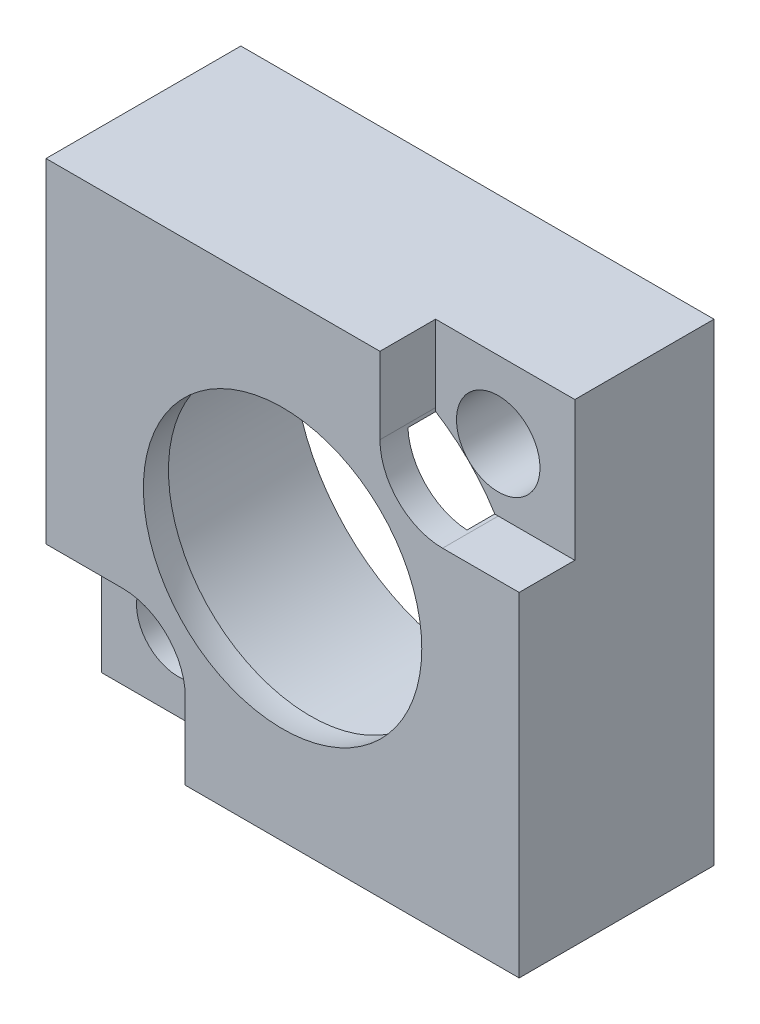
ISO-10303-21;
HEADER;
FILE_DESCRIPTION(('STEP AP214'),'2;1');
FILE_NAME('part.step','',(''),(''),'','','');
FILE_SCHEMA(('AUTOMOTIVE_DESIGN { 1 0 10303 214 1 1 1 1 }'));
ENDSEC;
DATA;
#1=APPLICATION_CONTEXT('core data for automotive mechanical design processes');
#2=APPLICATION_PROTOCOL_DEFINITION('international standard','automotive_design',2000,#1);
#3=PRODUCT_CONTEXT('',#1,'mechanical');
#4=PRODUCT('Part','Part','',(#3));
#5=PRODUCT_RELATED_PRODUCT_CATEGORY('part','',(#4));
#6=PRODUCT_DEFINITION_FORMATION('','',#4);
#7=PRODUCT_DEFINITION_CONTEXT('part definition',#1,'design');
#8=PRODUCT_DEFINITION('design','',#6,#7);
#9=PRODUCT_DEFINITION_SHAPE('','',#8);
#10=(LENGTH_UNIT() NAMED_UNIT(*) SI_UNIT(.MILLI.,.METRE.));
#11=(NAMED_UNIT(*) PLANE_ANGLE_UNIT() SI_UNIT($,.RADIAN.));
#12=(NAMED_UNIT(*) SI_UNIT($,.STERADIAN.) SOLID_ANGLE_UNIT());
#13=UNCERTAINTY_MEASURE_WITH_UNIT(LENGTH_MEASURE(1.E-05),#10,'distance_accuracy_value','');
#14=(GEOMETRIC_REPRESENTATION_CONTEXT(3) GLOBAL_UNCERTAINTY_ASSIGNED_CONTEXT((#13)) GLOBAL_UNIT_ASSIGNED_CONTEXT((#10,
#11,#12)) REPRESENTATION_CONTEXT('',''));
#15=CARTESIAN_POINT('',(0.,0.,0.));
#16=DIRECTION('',(0.,0.,1.));
#17=DIRECTION('',(1.,0.,0.));
#18=AXIS2_PLACEMENT_3D('',#15,#16,#17);
#19=CARTESIAN_POINT('',(0.,0.,6.));
#20=DIRECTION('',(0.,0.,1.));
#21=DIRECTION('',(1.,0.,0.));
#22=AXIS2_PLACEMENT_3D('',#19,#20,#21);
#23=PLANE('',#22);
#24=CARTESIAN_POINT('',(0.,0.,6.));
#25=DIRECTION('',(0.,0.,1.));
#26=DIRECTION('',(1.,0.,0.));
#27=AXIS2_PLACEMENT_3D('',#24,#25,#26);
#28=CIRCLE('',#27,5.00099990001999);
#29=CARTESIAN_POINT('',(5.00099990001999,0.,6.));
#30=VERTEX_POINT('',#29);
#31=EDGE_CURVE('E167',#30,#30,#28,.T.);
#32=ORIENTED_EDGE('',*,*,#31,.F.);
#33=EDGE_LOOP('',(#32));
#34=FACE_BOUND('',#33,.T.);
#35=DIRECTION('',(-1.,0.,0.));
#36=VECTOR('',#35,1.);
#37=CARTESIAN_POINT('',(0.,-3.49771727612784,6.00000000000003));
#38=LINE('',#37,#36);
#39=CARTESIAN_POINT('',(-5.74771727612784,-3.49771727612784,6.00000000000008));
#40=VERTEX_POINT('',#39);
#41=CARTESIAN_POINT('',(-8.49999999999995,-3.49771727612784,6.00000000000011));
#42=VERTEX_POINT('',#41);
#43=EDGE_CURVE('E196',#40,#42,#38,.T.);
#44=ORIENTED_EDGE('',*,*,#43,.F.);
#45=CARTESIAN_POINT('',(-5.74771727612784,-5.74771727612784,6.0000000000001));
#46=DIRECTION('',(0.,0.,-1.));
#47=DIRECTION('',(0.,-1.,0.));
#48=AXIS2_PLACEMENT_3D('',#45,#46,#47);
#49=CIRCLE('',#48,2.25);
#50=CARTESIAN_POINT('',(-3.49771727612784,-5.74771727612784,6.00000000000008));
#51=VERTEX_POINT('',#50);
#52=EDGE_CURVE('E199',#40,#51,#49,.T.);
#53=ORIENTED_EDGE('',*,*,#52,.T.);
#54=DIRECTION('',(0.,1.,0.));
#55=VECTOR('',#54,1.);
#56=CARTESIAN_POINT('',(-3.49771727612784,0.,6.00000000000003));
#57=LINE('',#56,#55);
#58=CARTESIAN_POINT('',(-3.49771727612784,-8.49999999999993,6.00000000000011));
#59=VERTEX_POINT('',#58);
#60=EDGE_CURVE('E212',#59,#51,#57,.T.);
#61=ORIENTED_EDGE('',*,*,#60,.F.);
#62=DIRECTION('',(1.,0.,0.));
#63=VECTOR('',#62,1.);
#64=CARTESIAN_POINT('',(0.,-8.5,6.));
#65=LINE('',#64,#63);
#66=CARTESIAN_POINT('',(8.50000000000003,-8.49999999999997,6.));
#67=VERTEX_POINT('',#66);
#68=EDGE_CURVE('E269',#59,#67,#65,.T.);
#69=ORIENTED_EDGE('',*,*,#68,.T.);
#70=DIRECTION('',(0.,1.,0.));
#71=VECTOR('',#70,1.);
#72=CARTESIAN_POINT('',(8.5,0.,6.));
#73=LINE('',#72,#71);
#74=CARTESIAN_POINT('',(8.49999999999999,3.49771727612789,6.));
#75=VERTEX_POINT('',#74);
#76=EDGE_CURVE('E266',#67,#75,#73,.T.);
#77=ORIENTED_EDGE('',*,*,#76,.T.);
#78=DIRECTION('',(-1.,0.,0.));
#79=VECTOR('',#78,1.);
#80=CARTESIAN_POINT('',(0.,3.49771727612789,6.));
#81=LINE('',#80,#79);
#82=CARTESIAN_POINT('',(5.74771727612789,3.49771727612789,6.));
#83=VERTEX_POINT('',#82);
#84=EDGE_CURVE('E236',#75,#83,#81,.T.);
#85=ORIENTED_EDGE('',*,*,#84,.T.);
#86=CARTESIAN_POINT('',(5.74771727612789,5.74771727612789,6.));
#87=DIRECTION('',(0.,0.,1.));
#88=DIRECTION('',(1.,0.,0.));
#89=AXIS2_PLACEMENT_3D('',#86,#87,#88);
#90=CIRCLE('',#89,2.25);
#91=CARTESIAN_POINT('',(3.49771727612789,5.74771727612789,6.));
#92=VERTEX_POINT('',#91);
#93=EDGE_CURVE('E250',#92,#83,#90,.T.);
#94=ORIENTED_EDGE('',*,*,#93,.F.);
#95=DIRECTION('',(0.,1.,0.));
#96=VECTOR('',#95,1.);
#97=CARTESIAN_POINT('',(3.49771727612789,0.,6.));
#98=LINE('',#97,#96);
#99=CARTESIAN_POINT('',(3.49771727612789,8.5,6.));
#100=VERTEX_POINT('',#99);
#101=EDGE_CURVE('E232',#92,#100,#98,.T.);
#102=ORIENTED_EDGE('',*,*,#101,.T.);
#103=DIRECTION('',(-1.,0.,0.));
#104=VECTOR('',#103,1.);
#105=CARTESIAN_POINT('',(0.,8.5,6.));
#106=LINE('',#105,#104);
#107=CARTESIAN_POINT('',(-8.50000000000009,8.49999999999991,6.));
#108=VERTEX_POINT('',#107);
#109=EDGE_CURVE('E264',#100,#108,#106,.T.);
#110=ORIENTED_EDGE('',*,*,#109,.T.);
#111=DIRECTION('',(0.,-1.,0.));
#112=VECTOR('',#111,1.);
#113=CARTESIAN_POINT('',(-8.5,0.,6.));
#114=LINE('',#113,#112);
#115=EDGE_CURVE('E271',#108,#42,#114,.T.);
#116=ORIENTED_EDGE('',*,*,#115,.T.);
#117=EDGE_LOOP('',(#44,#53,#61,#69,#77,#85,#94,#102,#110,#116));
#118=FACE_BOUND('',#117,.T.);
#119=ADVANCED_FACE('F41',(#34,#118),#23,.T.);
#120=CARTESIAN_POINT('',(8.5,0.,3.));
#121=DIRECTION('',(-1.,0.,0.));
#122=DIRECTION('',(0.,0.,1.));
#123=AXIS2_PLACEMENT_3D('',#120,#121,#122);
#124=PLANE('',#123);
#125=DIRECTION('',(0.,0.,1.));
#126=VECTOR('',#125,1.);
#127=CARTESIAN_POINT('',(8.49999999999999,3.49771727612789,4.));
#128=LINE('',#127,#126);
#129=CARTESIAN_POINT('',(8.49999999999999,3.49771727612789,4.));
#130=VERTEX_POINT('',#129);
#131=EDGE_CURVE('E256',#130,#75,#128,.T.);
#132=ORIENTED_EDGE('',*,*,#131,.T.);
#133=ORIENTED_EDGE('',*,*,#76,.F.);
#134=DIRECTION('',(0.,0.,1.));
#135=VECTOR('',#134,1.);
#136=CARTESIAN_POINT('',(8.5,-8.5,-1.));
#137=LINE('',#136,#135);
#138=CARTESIAN_POINT('',(8.5,-8.5,-1.));
#139=VERTEX_POINT('',#138);
#140=EDGE_CURVE('E285',#139,#67,#137,.T.);
#141=ORIENTED_EDGE('',*,*,#140,.F.);
#142=DIRECTION('',(0.,-1.,0.));
#143=VECTOR('',#142,1.);
#144=CARTESIAN_POINT('',(8.5,-8.5,-1.));
#145=LINE('',#144,#143);
#146=CARTESIAN_POINT('',(8.5,8.5,-1.));
#147=VERTEX_POINT('',#146);
#148=EDGE_CURVE('E278',#147,#139,#145,.T.);
#149=ORIENTED_EDGE('',*,*,#148,.F.);
#150=DIRECTION('',(0.,0.,1.));
#151=VECTOR('',#150,1.);
#152=CARTESIAN_POINT('',(8.5,8.5,-1.));
#153=LINE('',#152,#151);
#154=CARTESIAN_POINT('',(8.5,8.5,4.));
#155=VERTEX_POINT('',#154);
#156=EDGE_CURVE('E288',#147,#155,#153,.T.);
#157=ORIENTED_EDGE('',*,*,#156,.T.);
#158=DIRECTION('',(0.,1.,0.));
#159=VECTOR('',#158,1.);
#160=CARTESIAN_POINT('',(8.5,0.,4.));
#161=LINE('',#160,#159);
#162=EDGE_CURVE('E242',#130,#155,#161,.T.);
#163=ORIENTED_EDGE('',*,*,#162,.F.);
#164=EDGE_LOOP('',(#132,#133,#141,#149,#157,#163));
#165=FACE_BOUND('',#164,.T.);
#166=ADVANCED_FACE('F43',(#165),#124,.F.);
#167=CARTESIAN_POINT('',(0.,8.5,3.));
#168=DIRECTION('',(0.,1.,0.));
#169=DIRECTION('',(0.,0.,1.));
#170=AXIS2_PLACEMENT_3D('',#167,#168,#169);
#171=PLANE('',#170);
#172=ORIENTED_EDGE('',*,*,#109,.F.);
#173=DIRECTION('',(0.,0.,1.));
#174=VECTOR('',#173,1.);
#175=CARTESIAN_POINT('',(3.49771727612789,8.5,4.));
#176=LINE('',#175,#174);
#177=CARTESIAN_POINT('',(3.49771727612789,8.5,4.));
#178=VERTEX_POINT('',#177);
#179=EDGE_CURVE('E168',#178,#100,#176,.T.);
#180=ORIENTED_EDGE('',*,*,#179,.F.);
#181=DIRECTION('',(-1.,0.,0.));
#182=VECTOR('',#181,1.);
#183=CARTESIAN_POINT('',(0.,8.5,4.));
#184=LINE('',#183,#182);
#185=EDGE_CURVE('E244',#155,#178,#184,.T.);
#186=ORIENTED_EDGE('',*,*,#185,.F.);
#187=ORIENTED_EDGE('',*,*,#156,.F.);
#188=DIRECTION('',(1.,0.,0.));
#189=VECTOR('',#188,1.);
#190=CARTESIAN_POINT('',(8.5,8.5,-1.));
#191=LINE('',#190,#189);
#192=CARTESIAN_POINT('',(-8.5,8.5,-1.));
#193=VERTEX_POINT('',#192);
#194=EDGE_CURVE('E276',#193,#147,#191,.T.);
#195=ORIENTED_EDGE('',*,*,#194,.F.);
#196=DIRECTION('',(0.,0.,1.));
#197=VECTOR('',#196,1.);
#198=CARTESIAN_POINT('',(-8.5,8.5,-1.));
#199=LINE('',#198,#197);
#200=EDGE_CURVE('E291',#193,#108,#199,.T.);
#201=ORIENTED_EDGE('',*,*,#200,.T.);
#202=EDGE_LOOP('',(#172,#180,#186,#187,#195,#201));
#203=FACE_BOUND('',#202,.T.);
#204=ADVANCED_FACE('F320',(#203),#171,.T.);
#205=CARTESIAN_POINT('',(0.,0.,5.));
#206=DIRECTION('',(0.,0.,1.));
#207=DIRECTION('',(1.,0.,0.));
#208=AXIS2_PLACEMENT_3D('',#205,#206,#207);
#209=PLANE('',#208);
#210=CARTESIAN_POINT('',(-5.74771727612785,-5.74771727612785,5.));
#211=DIRECTION('',(0.,0.,1.));
#212=DIRECTION('',(1.,0.,0.));
#213=AXIS2_PLACEMENT_3D('',#210,#211,#212);
#214=CIRCLE('',#213,2.25);
#215=CARTESIAN_POINT('',(-5.62431293809895,-3.50110396508483,5.));
#216=VERTEX_POINT('',#215);
#217=CARTESIAN_POINT('',(-3.50110396508484,-5.62431293809895,5.));
#218=VERTEX_POINT('',#217);
#219=EDGE_CURVE('E177',#216,#218,#214,.F.);
#220=ORIENTED_EDGE('',*,*,#219,.F.);
#221=CARTESIAN_POINT('',(0.,0.,5.));
#222=DIRECTION('',(0.,0.,-1.));
#223=DIRECTION('',(-1.,0.,0.));
#224=AXIS2_PLACEMENT_3D('',#221,#222,#223);
#225=CIRCLE('',#224,6.625);
#226=CARTESIAN_POINT('',(3.50110396508488,5.62431293809892,5.));
#227=VERTEX_POINT('',#226);
#228=EDGE_CURVE('E171',#216,#227,#225,.T.);
#229=ORIENTED_EDGE('',*,*,#228,.T.);
#230=CARTESIAN_POINT('',(5.74771727612789,5.74771727612789,5.));
#231=DIRECTION('',(0.,0.,1.));
#232=DIRECTION('',(1.,0.,0.));
#233=AXIS2_PLACEMENT_3D('',#230,#231,#232);
#234=CIRCLE('',#233,2.25);
#235=CARTESIAN_POINT('',(5.62431293809892,3.50110396508488,5.));
#236=VERTEX_POINT('',#235);
#237=EDGE_CURVE('E155',#227,#236,#234,.T.);
#238=ORIENTED_EDGE('',*,*,#237,.T.);
#239=EDGE_CURVE('E178',#236,#218,#225,.T.);
#240=ORIENTED_EDGE('',*,*,#239,.T.);
#241=EDGE_LOOP('',(#220,#229,#238,#240));
#242=FACE_BOUND('',#241,.T.);
#243=CARTESIAN_POINT('',(0.,0.,5.));
#244=DIRECTION('',(0.,0.,1.));
#245=DIRECTION('',(1.,0.,0.));
#246=AXIS2_PLACEMENT_3D('',#243,#244,#245);
#247=CIRCLE('',#246,5.1);
#248=CARTESIAN_POINT('',(5.1,0.,5.));
#249=VERTEX_POINT('',#248);
#250=EDGE_CURVE('E49',#249,#249,#247,.T.);
#251=ORIENTED_EDGE('',*,*,#250,.T.);
#252=EDGE_LOOP('',(#251));
#253=FACE_BOUND('',#252,.T.);
#254=ADVANCED_FACE('F175',(#242,#253),#209,.F.);
#255=CARTESIAN_POINT('',(-8.5,0.,3.));
#256=DIRECTION('',(-1.,0.,0.));
#257=DIRECTION('',(0.,0.,1.));
#258=AXIS2_PLACEMENT_3D('',#255,#256,#257);
#259=PLANE('',#258);
#260=DIRECTION('',(0.,0.,1.));
#261=VECTOR('',#260,1.);
#262=CARTESIAN_POINT('',(-8.49999999999997,-3.49771727612785,4.00000000000011));
#263=LINE('',#262,#261);
#264=CARTESIAN_POINT('',(-8.49999999999997,-3.49771727612785,4.00000000000011));
#265=VERTEX_POINT('',#264);
#266=EDGE_CURVE('E210',#265,#42,#263,.T.);
#267=ORIENTED_EDGE('',*,*,#266,.T.);
#268=ORIENTED_EDGE('',*,*,#115,.F.);
#269=ORIENTED_EDGE('',*,*,#200,.F.);
#270=DIRECTION('',(0.,1.,0.));
#271=VECTOR('',#270,1.);
#272=CARTESIAN_POINT('',(-8.5,-8.5,-1.));
#273=LINE('',#272,#271);
#274=CARTESIAN_POINT('',(-8.5,-8.5,-1.));
#275=VERTEX_POINT('',#274);
#276=EDGE_CURVE('E274',#275,#193,#273,.T.);
#277=ORIENTED_EDGE('',*,*,#276,.F.);
#278=DIRECTION('',(0.,0.,1.));
#279=VECTOR('',#278,1.);
#280=CARTESIAN_POINT('',(-8.5,-8.5,-1.));
#281=LINE('',#280,#279);
#282=CARTESIAN_POINT('',(-8.5,-8.5,4.00000000000013));
#283=VERTEX_POINT('',#282);
#284=EDGE_CURVE('E282',#275,#283,#281,.T.);
#285=ORIENTED_EDGE('',*,*,#284,.T.);
#286=DIRECTION('',(0.,1.,0.));
#287=VECTOR('',#286,1.);
#288=CARTESIAN_POINT('',(-8.49999999999996,0.,4.00000000000008));
#289=LINE('',#288,#287);
#290=EDGE_CURVE('E63',#283,#265,#289,.T.);
#291=ORIENTED_EDGE('',*,*,#290,.T.);
#292=EDGE_LOOP('',(#267,#268,#269,#277,#285,#291));
#293=FACE_BOUND('',#292,.T.);
#294=ADVANCED_FACE('F327',(#293),#259,.T.);
#295=CARTESIAN_POINT('',(0.,-8.5,3.));
#296=DIRECTION('',(0.,1.,0.));
#297=DIRECTION('',(0.,0.,1.));
#298=AXIS2_PLACEMENT_3D('',#295,#296,#297);
#299=PLANE('',#298);
#300=ORIENTED_EDGE('',*,*,#68,.F.);
#301=DIRECTION('',(0.,0.,1.));
#302=VECTOR('',#301,1.);
#303=CARTESIAN_POINT('',(-3.49771727612786,-8.49999999999995,4.00000000000011));
#304=LINE('',#303,#302);
#305=CARTESIAN_POINT('',(-3.49771727612786,-8.49999999999995,4.00000000000011));
#306=VERTEX_POINT('',#305);
#307=EDGE_CURVE('E221',#306,#59,#304,.T.);
#308=ORIENTED_EDGE('',*,*,#307,.F.);
#309=DIRECTION('',(-1.,0.,0.));
#310=VECTOR('',#309,1.);
#311=CARTESIAN_POINT('',(0.,-8.49999999999996,4.00000000000008));
#312=LINE('',#311,#310);
#313=EDGE_CURVE('E201',#306,#283,#312,.T.);
#314=ORIENTED_EDGE('',*,*,#313,.T.);
#315=ORIENTED_EDGE('',*,*,#284,.F.);
#316=DIRECTION('',(-1.,0.,0.));
#317=VECTOR('',#316,1.);
#318=CARTESIAN_POINT('',(8.5,-8.5,-1.));
#319=LINE('',#318,#317);
#320=EDGE_CURVE('E280',#139,#275,#319,.T.);
#321=ORIENTED_EDGE('',*,*,#320,.F.);
#322=ORIENTED_EDGE('',*,*,#140,.T.);
#323=EDGE_LOOP('',(#300,#308,#314,#315,#321,#322));
#324=FACE_BOUND('',#323,.T.);
#325=ADVANCED_FACE('F308',(#324),#299,.F.);
#326=CARTESIAN_POINT('',(0.,0.,-1.));
#327=DIRECTION('',(0.,0.,1.));
#328=DIRECTION('',(1.,0.,0.));
#329=AXIS2_PLACEMENT_3D('',#326,#327,#328);
#330=PLANE('',#329);
#331=CARTESIAN_POINT('',(0.,0.,-1.));
#332=DIRECTION('',(0.,0.,-1.));
#333=DIRECTION('',(-1.,0.,0.));
#334=AXIS2_PLACEMENT_3D('',#331,#332,#333);
#335=CIRCLE('',#334,6.625);
#336=CARTESIAN_POINT('',(-6.625,0.,-1.));
#337=VERTEX_POINT('',#336);
#338=EDGE_CURVE('E179',#337,#337,#335,.T.);
#339=ORIENTED_EDGE('',*,*,#338,.F.);
#340=EDGE_LOOP('',(#339));
#341=FACE_BOUND('',#340,.T.);
#342=CARTESIAN_POINT('',(-5.74771727612791,-5.7477172761279,-1.));
#343=DIRECTION('',(0.,0.,1.));
#344=DIRECTION('',(1.,0.,0.));
#345=AXIS2_PLACEMENT_3D('',#342,#343,#344);
#346=CIRCLE('',#345,1.5);
#347=CARTESIAN_POINT('',(-4.24771727612791,-5.7477172761279,-1.));
#348=VERTEX_POINT('',#347);
#349=EDGE_CURVE('E193',#348,#348,#346,.F.);
#350=ORIENTED_EDGE('',*,*,#349,.F.);
#351=EDGE_LOOP('',(#350));
#352=FACE_BOUND('',#351,.T.);
#353=CARTESIAN_POINT('',(5.74771727612789,5.74771727612789,-1.));
#354=DIRECTION('',(0.,0.,1.));
#355=DIRECTION('',(1.,0.,0.));
#356=AXIS2_PLACEMENT_3D('',#353,#354,#355);
#357=CIRCLE('',#356,1.5);
#358=CARTESIAN_POINT('',(7.24771727612789,5.74771727612789,-1.));
#359=VERTEX_POINT('',#358);
#360=EDGE_CURVE('E229',#359,#359,#357,.T.);
#361=ORIENTED_EDGE('',*,*,#360,.T.);
#362=EDGE_LOOP('',(#361));
#363=FACE_BOUND('',#362,.T.);
#364=ORIENTED_EDGE('',*,*,#194,.T.);
#365=ORIENTED_EDGE('',*,*,#148,.T.);
#366=ORIENTED_EDGE('',*,*,#320,.T.);
#367=ORIENTED_EDGE('',*,*,#276,.T.);
#368=EDGE_LOOP('',(#364,#365,#366,#367));
#369=FACE_BOUND('',#368,.T.);
#370=ADVANCED_FACE('F298',(#341,#352,#363,#369),#330,.F.);
#371=CARTESIAN_POINT('',(0.,0.,5.));
#372=DIRECTION('',(-1.,0.,0.));
#373=DIRECTION('',(0.,1.,0.));
#374=AXIS2_PLACEMENT_3D('',#371,#372,#373);
#375=SPHERICAL_SURFACE('',#374,5.1);
#376=CARTESIAN_POINT('',(0.,0.,5.));
#377=DIRECTION('',(0.,0.,1.));
#378=DIRECTION('',(1.,0.,0.));
#379=AXIS2_PLACEMENT_3D('',#376,#377,#378);
#380=SPHERICAL_SURFACE('',#379,5.1);
#381=ORIENTED_EDGE('',*,*,#31,.T.);
#382=EDGE_LOOP('',(#381));
#383=FACE_BOUND('',#382,.T.);
#384=ORIENTED_EDGE('',*,*,#250,.F.);
#385=EDGE_LOOP('',(#384));
#386=FACE_BOUND('',#385,.T.);
#387=ADVANCED_FACE('F296',(#383,#386),#380,.F.);
#388=CARTESIAN_POINT('',(5.74771727612789,5.74771727612789,4.));
#389=DIRECTION('',(0.,0.,1.));
#390=DIRECTION('',(1.,0.,0.));
#391=AXIS2_PLACEMENT_3D('',#388,#389,#390);
#392=CYLINDRICAL_SURFACE('',#391,2.25);
#393=ORIENTED_EDGE('',*,*,#237,.F.);
#394=DIRECTION('',(0.,0.,-1.));
#395=VECTOR('',#394,1.);
#396=CARTESIAN_POINT('',(3.50110396508488,5.62431293809892,2.));
#397=LINE('',#396,#395);
#398=CARTESIAN_POINT('',(3.50110396508488,5.62431293809892,4.));
#399=VERTEX_POINT('',#398);
#400=EDGE_CURVE('E159',#227,#399,#397,.T.);
#401=ORIENTED_EDGE('',*,*,#400,.T.);
#402=CARTESIAN_POINT('',(5.74771727612789,5.74771727612789,4.));
#403=DIRECTION('',(0.,0.,1.));
#404=DIRECTION('',(1.,0.,0.));
#405=AXIS2_PLACEMENT_3D('',#402,#403,#404);
#406=CIRCLE('',#405,2.25);
#407=CARTESIAN_POINT('',(3.49771727612789,5.74771727612789,4.));
#408=VERTEX_POINT('',#407);
#409=EDGE_CURVE('E237',#408,#399,#406,.T.);
#410=ORIENTED_EDGE('',*,*,#409,.F.);
#411=DIRECTION('',(0.,0.,1.));
#412=VECTOR('',#411,1.);
#413=CARTESIAN_POINT('',(3.49771727612789,5.74771727612789,4.));
#414=LINE('',#413,#412);
#415=EDGE_CURVE('E247',#408,#92,#414,.T.);
#416=ORIENTED_EDGE('',*,*,#415,.T.);
#417=ORIENTED_EDGE('',*,*,#93,.T.);
#418=DIRECTION('',(0.,0.,1.));
#419=VECTOR('',#418,1.);
#420=CARTESIAN_POINT('',(5.74771727612789,3.49771727612789,4.));
#421=LINE('',#420,#419);
#422=CARTESIAN_POINT('',(5.74771727612789,3.49771727612789,4.));
#423=VERTEX_POINT('',#422);
#424=EDGE_CURVE('E259',#423,#83,#421,.T.);
#425=ORIENTED_EDGE('',*,*,#424,.F.);
#426=CARTESIAN_POINT('',(5.62431293809892,3.50110396508488,4.));
#427=VERTEX_POINT('',#426);
#428=EDGE_CURVE('E235',#427,#423,#406,.T.);
#429=ORIENTED_EDGE('',*,*,#428,.F.);
#430=DIRECTION('',(0.,0.,-1.));
#431=VECTOR('',#430,1.);
#432=CARTESIAN_POINT('',(5.62431293809892,3.50110396508489,2.));
#433=LINE('',#432,#431);
#434=EDGE_CURVE('E162',#427,#236,#433,.F.);
#435=ORIENTED_EDGE('',*,*,#434,.T.);
#436=EDGE_LOOP('',(#393,#401,#410,#416,#417,#425,#429,#435));
#437=FACE_BOUND('',#436,.T.);
#438=ADVANCED_FACE('F157',(#437),#392,.F.);
#439=CARTESIAN_POINT('',(0.,0.,4.));
#440=DIRECTION('',(0.,0.,1.));
#441=DIRECTION('',(1.,0.,0.));
#442=AXIS2_PLACEMENT_3D('',#439,#440,#441);
#443=PLANE('',#442);
#444=CARTESIAN_POINT('',(0.,0.,4.));
#445=DIRECTION('',(0.,0.,1.));
#446=DIRECTION('',(1.,0.,0.));
#447=AXIS2_PLACEMENT_3D('',#444,#445,#446);
#448=CIRCLE('',#447,6.625);
#449=EDGE_CURVE('E173',#427,#399,#448,.T.);
#450=ORIENTED_EDGE('',*,*,#449,.F.);
#451=ORIENTED_EDGE('',*,*,#428,.T.);
#452=DIRECTION('',(-1.,0.,0.));
#453=VECTOR('',#452,1.);
#454=CARTESIAN_POINT('',(0.,3.49771727612789,4.));
#455=LINE('',#454,#453);
#456=EDGE_CURVE('E239',#130,#423,#455,.T.);
#457=ORIENTED_EDGE('',*,*,#456,.F.);
#458=ORIENTED_EDGE('',*,*,#162,.T.);
#459=ORIENTED_EDGE('',*,*,#185,.T.);
#460=DIRECTION('',(0.,1.,0.));
#461=VECTOR('',#460,1.);
#462=CARTESIAN_POINT('',(3.49771727612789,0.,4.));
#463=LINE('',#462,#461);
#464=EDGE_CURVE('E233',#408,#178,#463,.T.);
#465=ORIENTED_EDGE('',*,*,#464,.F.);
#466=ORIENTED_EDGE('',*,*,#409,.T.);
#467=EDGE_LOOP('',(#450,#451,#457,#458,#459,#465,#466));
#468=FACE_BOUND('',#467,.T.);
#469=CARTESIAN_POINT('',(5.74771727612789,5.74771727612789,4.));
#470=DIRECTION('',(0.,0.,1.));
#471=DIRECTION('',(1.,0.,0.));
#472=AXIS2_PLACEMENT_3D('',#469,#470,#471);
#473=CIRCLE('',#472,1.5);
#474=CARTESIAN_POINT('',(7.24771727612789,5.74771727612789,4.));
#475=VERTEX_POINT('',#474);
#476=EDGE_CURVE('E226',#475,#475,#473,.T.);
#477=ORIENTED_EDGE('',*,*,#476,.F.);
#478=EDGE_LOOP('',(#477));
#479=FACE_BOUND('',#478,.T.);
#480=ADVANCED_FACE('F305',(#468,#479),#443,.T.);
#481=CARTESIAN_POINT('',(3.49771727612789,0.,4.));
#482=DIRECTION('',(1.,0.,0.));
#483=DIRECTION('',(0.,1.,0.));
#484=AXIS2_PLACEMENT_3D('',#481,#482,#483);
#485=PLANE('',#484);
#486=ORIENTED_EDGE('',*,*,#101,.F.);
#487=ORIENTED_EDGE('',*,*,#415,.F.);
#488=ORIENTED_EDGE('',*,*,#464,.T.);
#489=ORIENTED_EDGE('',*,*,#179,.T.);
#490=EDGE_LOOP('',(#486,#487,#488,#489));
#491=FACE_BOUND('',#490,.T.);
#492=ADVANCED_FACE('F346',(#491),#485,.T.);
#493=CARTESIAN_POINT('',(0.,3.49771727612789,4.));
#494=DIRECTION('',(0.,1.,0.));
#495=DIRECTION('',(-1.,0.,0.));
#496=AXIS2_PLACEMENT_3D('',#493,#494,#495);
#497=PLANE('',#496);
#498=ORIENTED_EDGE('',*,*,#84,.F.);
#499=ORIENTED_EDGE('',*,*,#131,.F.);
#500=ORIENTED_EDGE('',*,*,#456,.T.);
#501=ORIENTED_EDGE('',*,*,#424,.T.);
#502=EDGE_LOOP('',(#498,#499,#500,#501));
#503=FACE_BOUND('',#502,.T.);
#504=ADVANCED_FACE('F376',(#503),#497,.T.);
#505=CARTESIAN_POINT('',(5.74771727612789,5.74771727612789,-4.));
#506=DIRECTION('',(0.,0.,1.));
#507=DIRECTION('',(1.,0.,0.));
#508=AXIS2_PLACEMENT_3D('',#505,#506,#507);
#509=CYLINDRICAL_SURFACE('',#508,1.5);
#510=ORIENTED_EDGE('',*,*,#476,.T.);
#511=EDGE_LOOP('',(#510));
#512=FACE_BOUND('',#511,.T.);
#513=ORIENTED_EDGE('',*,*,#360,.F.);
#514=EDGE_LOOP('',(#513));
#515=FACE_BOUND('',#514,.T.);
#516=ADVANCED_FACE('F379',(#512,#515),#509,.F.);
#517=CARTESIAN_POINT('',(-5.74771727612786,-5.74771727612786,4.0000000000001));
#518=DIRECTION('',(0.,0.,1.));
#519=DIRECTION('',(1.,0.,0.));
#520=AXIS2_PLACEMENT_3D('',#517,#518,#519);
#521=CYLINDRICAL_SURFACE('',#520,2.25);
#522=DIRECTION('',(0.,0.,-1.));
#523=VECTOR('',#522,1.);
#524=CARTESIAN_POINT('',(-5.62431293809893,-3.50110396508486,2.));
#525=LINE('',#524,#523);
#526=CARTESIAN_POINT('',(-5.62431293809895,-3.50110396508484,4.00000000000008));
#527=VERTEX_POINT('',#526);
#528=EDGE_CURVE('E55',#216,#527,#525,.T.);
#529=ORIENTED_EDGE('',*,*,#528,.F.);
#530=ORIENTED_EDGE('',*,*,#219,.T.);
#531=DIRECTION('',(0.,0.,-1.));
#532=VECTOR('',#531,1.);
#533=CARTESIAN_POINT('',(-3.50110396508487,-5.62431293809893,2.));
#534=LINE('',#533,#532);
#535=CARTESIAN_POINT('',(-3.50110396508485,-5.62431293809894,4.00000000000008));
#536=VERTEX_POINT('',#535);
#537=EDGE_CURVE('E181',#536,#218,#534,.F.);
#538=ORIENTED_EDGE('',*,*,#537,.F.);
#539=CARTESIAN_POINT('',(-5.74771727612786,-5.74771727612786,4.0000000000001));
#540=DIRECTION('',(0.,0.,-1.));
#541=DIRECTION('',(0.,-1.,0.));
#542=AXIS2_PLACEMENT_3D('',#539,#540,#541);
#543=CIRCLE('',#542,2.25);
#544=CARTESIAN_POINT('',(-3.49771727612786,-5.74771727612786,4.00000000000008));
#545=VERTEX_POINT('',#544);
#546=EDGE_CURVE('E206',#536,#545,#543,.T.);
#547=ORIENTED_EDGE('',*,*,#546,.T.);
#548=DIRECTION('',(0.,0.,1.));
#549=VECTOR('',#548,1.);
#550=CARTESIAN_POINT('',(-3.49771727612786,-5.74771727612786,4.00000000000008));
#551=LINE('',#550,#549);
#552=EDGE_CURVE('E219',#545,#51,#551,.T.);
#553=ORIENTED_EDGE('',*,*,#552,.T.);
#554=ORIENTED_EDGE('',*,*,#52,.F.);
#555=DIRECTION('',(0.,0.,1.));
#556=VECTOR('',#555,1.);
#557=CARTESIAN_POINT('',(-5.74771727612786,-3.49771727612786,4.00000000000008));
#558=LINE('',#557,#556);
#559=CARTESIAN_POINT('',(-5.74771727612786,-3.49771727612786,4.00000000000008));
#560=VERTEX_POINT('',#559);
#561=EDGE_CURVE('E217',#560,#40,#558,.T.);
#562=ORIENTED_EDGE('',*,*,#561,.F.);
#563=EDGE_CURVE('E207',#560,#527,#543,.T.);
#564=ORIENTED_EDGE('',*,*,#563,.T.);
#565=EDGE_LOOP('',(#529,#530,#538,#547,#553,#554,#562,#564));
#566=FACE_BOUND('',#565,.T.);
#567=ADVANCED_FACE('F368',(#566),#521,.F.);
#568=CARTESIAN_POINT('',(0.,0.,4.));
#569=DIRECTION('',(0.,0.,1.));
#570=DIRECTION('',(0.,-1.,0.));
#571=AXIS2_PLACEMENT_3D('',#568,#569,#570);
#572=PLANE('',#571);
#573=CARTESIAN_POINT('',(0.,0.,4.));
#574=DIRECTION('',(0.,0.,1.));
#575=DIRECTION('',(1.,0.,0.));
#576=AXIS2_PLACEMENT_3D('',#573,#574,#575);
#577=CIRCLE('',#576,6.625);
#578=EDGE_CURVE('E11',#527,#536,#577,.T.);
#579=ORIENTED_EDGE('',*,*,#578,.F.);
#580=ORIENTED_EDGE('',*,*,#563,.F.);
#581=DIRECTION('',(-1.,0.,0.));
#582=VECTOR('',#581,1.);
#583=CARTESIAN_POINT('',(0.,-3.49771727612786,4.00000000000003));
#584=LINE('',#583,#582);
#585=EDGE_CURVE('E197',#560,#265,#584,.T.);
#586=ORIENTED_EDGE('',*,*,#585,.T.);
#587=ORIENTED_EDGE('',*,*,#290,.F.);
#588=ORIENTED_EDGE('',*,*,#313,.F.);
#589=DIRECTION('',(0.,1.,0.));
#590=VECTOR('',#589,1.);
#591=CARTESIAN_POINT('',(-3.49771727612786,0.,4.00000000000003));
#592=LINE('',#591,#590);
#593=EDGE_CURVE('E203',#306,#545,#592,.T.);
#594=ORIENTED_EDGE('',*,*,#593,.T.);
#595=ORIENTED_EDGE('',*,*,#546,.F.);
#596=EDGE_LOOP('',(#579,#580,#586,#587,#588,#594,#595));
#597=FACE_BOUND('',#596,.T.);
#598=CARTESIAN_POINT('',(-5.74771727612786,-5.74771727612786,4.0000000000001));
#599=DIRECTION('',(0.,0.,1.));
#600=DIRECTION('',(1.,0.,0.));
#601=AXIS2_PLACEMENT_3D('',#598,#599,#600);
#602=CIRCLE('',#601,1.5);
#603=CARTESIAN_POINT('',(-4.24771727612786,-5.74771727612786,4.00000000000009));
#604=VERTEX_POINT('',#603);
#605=EDGE_CURVE('E190',#604,#604,#602,.F.);
#606=ORIENTED_EDGE('',*,*,#605,.T.);
#607=EDGE_LOOP('',(#606));
#608=FACE_BOUND('',#607,.T.);
#609=ADVANCED_FACE('F364',(#597,#608),#572,.T.);
#610=CARTESIAN_POINT('',(0.,-3.49771727612786,4.00000000000003));
#611=DIRECTION('',(0.,1.,0.));
#612=DIRECTION('',(0.,0.,1.));
#613=AXIS2_PLACEMENT_3D('',#610,#611,#612);
#614=PLANE('',#613);
#615=ORIENTED_EDGE('',*,*,#43,.T.);
#616=ORIENTED_EDGE('',*,*,#266,.F.);
#617=ORIENTED_EDGE('',*,*,#585,.F.);
#618=ORIENTED_EDGE('',*,*,#561,.T.);
#619=EDGE_LOOP('',(#615,#616,#617,#618));
#620=FACE_BOUND('',#619,.T.);
#621=ADVANCED_FACE('F362',(#620),#614,.F.);
#622=CARTESIAN_POINT('',(-3.49771727612786,0.,4.00000000000003));
#623=DIRECTION('',(1.,0.,0.));
#624=DIRECTION('',(0.,0.,-1.));
#625=AXIS2_PLACEMENT_3D('',#622,#623,#624);
#626=PLANE('',#625);
#627=ORIENTED_EDGE('',*,*,#60,.T.);
#628=ORIENTED_EDGE('',*,*,#552,.F.);
#629=ORIENTED_EDGE('',*,*,#593,.F.);
#630=ORIENTED_EDGE('',*,*,#307,.T.);
#631=EDGE_LOOP('',(#627,#628,#629,#630));
#632=FACE_BOUND('',#631,.T.);
#633=ADVANCED_FACE('F390',(#632),#626,.F.);
#634=CARTESIAN_POINT('',(-5.74771727612793,-5.74771727612793,-3.9999999999999));
#635=DIRECTION('',(0.,0.,1.));
#636=DIRECTION('',(1.,0.,0.));
#637=AXIS2_PLACEMENT_3D('',#634,#635,#636);
#638=CYLINDRICAL_SURFACE('',#637,1.5);
#639=ORIENTED_EDGE('',*,*,#605,.F.);
#640=EDGE_LOOP('',(#639));
#641=FACE_BOUND('',#640,.T.);
#642=ORIENTED_EDGE('',*,*,#349,.T.);
#643=EDGE_LOOP('',(#642));
#644=FACE_BOUND('',#643,.T.);
#645=ADVANCED_FACE('F393',(#641,#644),#638,.F.);
#646=CARTESIAN_POINT('',(0.,0.,5.));
#647=DIRECTION('',(0.,0.,-1.));
#648=DIRECTION('',(-1.,0.,0.));
#649=AXIS2_PLACEMENT_3D('',#646,#647,#648);
#650=CYLINDRICAL_SURFACE('',#649,6.625);
#651=ORIENTED_EDGE('',*,*,#338,.T.);
#652=EDGE_LOOP('',(#651));
#653=FACE_BOUND('',#652,.T.);
#654=ORIENTED_EDGE('',*,*,#449,.T.);
#655=ORIENTED_EDGE('',*,*,#400,.F.);
#656=ORIENTED_EDGE('',*,*,#228,.F.);
#657=ORIENTED_EDGE('',*,*,#528,.T.);
#658=ORIENTED_EDGE('',*,*,#578,.T.);
#659=ORIENTED_EDGE('',*,*,#537,.T.);
#660=ORIENTED_EDGE('',*,*,#239,.F.);
#661=ORIENTED_EDGE('',*,*,#434,.F.);
#662=EDGE_LOOP('',(#654,#655,#656,#657,#658,#659,#660,#661));
#663=FACE_BOUND('',#662,.T.);
#664=ADVANCED_FACE('F170',(#653,#663),#650,.F.);
#665=CLOSED_SHELL('',(#119,#166,#204,#254,#294,#325,#370,#387,#438,#480,#492,#504,#516,#567,
#609,#621,#633,#645,#664));
#666=MANIFOLD_SOLID_BREP('B2',#665);
#667=ADVANCED_BREP_SHAPE_REPRESENTATION('',(#18,#666),#14);
#668=SHAPE_DEFINITION_REPRESENTATION(#9,#667);
ENDSEC;
END-ISO-10303-21;
